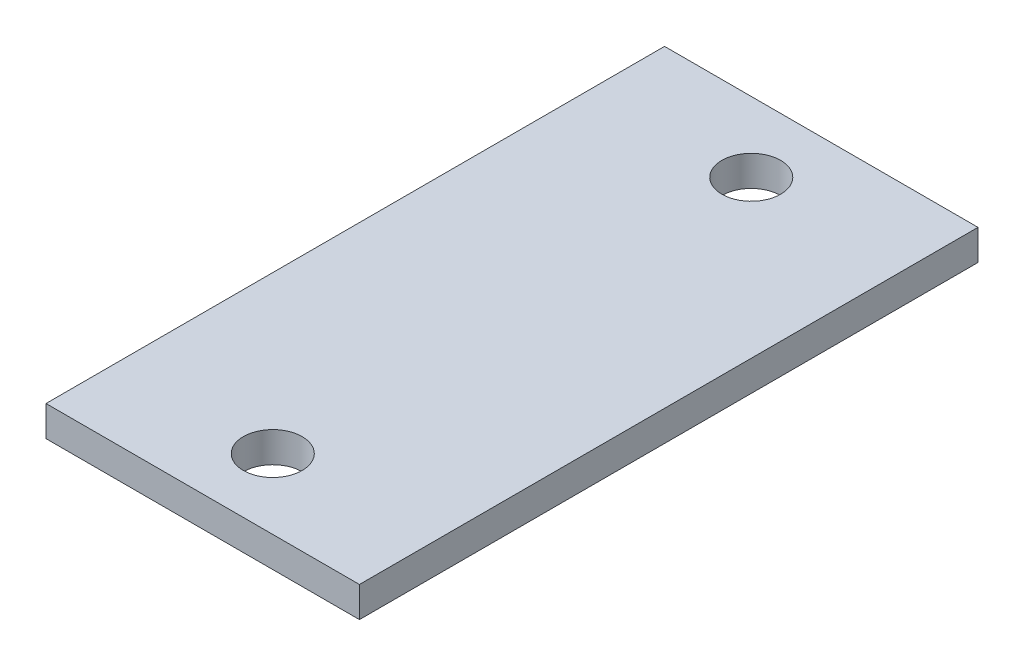
ISO-10303-21;
HEADER;
FILE_DESCRIPTION(('STEP AP214'),'2;1');
FILE_NAME('part.step','',(''),(''),'','','');
FILE_SCHEMA(('AUTOMOTIVE_DESIGN { 1 0 10303 214 1 1 1 1 }'));
ENDSEC;
DATA;
#1=APPLICATION_CONTEXT('core data for automotive mechanical design processes');
#2=APPLICATION_PROTOCOL_DEFINITION('international standard','automotive_design',2000,#1);
#3=PRODUCT_CONTEXT('',#1,'mechanical');
#4=PRODUCT('Part','Part','',(#3));
#5=PRODUCT_RELATED_PRODUCT_CATEGORY('part','',(#4));
#6=PRODUCT_DEFINITION_FORMATION('','',#4);
#7=PRODUCT_DEFINITION_CONTEXT('part definition',#1,'design');
#8=PRODUCT_DEFINITION('design','',#6,#7);
#9=PRODUCT_DEFINITION_SHAPE('','',#8);
#10=(LENGTH_UNIT() NAMED_UNIT(*) SI_UNIT(.MILLI.,.METRE.));
#11=(NAMED_UNIT(*) PLANE_ANGLE_UNIT() SI_UNIT($,.RADIAN.));
#12=(NAMED_UNIT(*) SI_UNIT($,.STERADIAN.) SOLID_ANGLE_UNIT());
#13=UNCERTAINTY_MEASURE_WITH_UNIT(LENGTH_MEASURE(1.E-05),#10,'distance_accuracy_value','');
#14=(GEOMETRIC_REPRESENTATION_CONTEXT(3) GLOBAL_UNCERTAINTY_ASSIGNED_CONTEXT((#13)) GLOBAL_UNIT_ASSIGNED_CONTEXT((#10,
#11,#12)) REPRESENTATION_CONTEXT('',''));
#15=CARTESIAN_POINT('',(0.,0.,0.));
#16=DIRECTION('',(0.,0.,1.));
#17=DIRECTION('',(1.,0.,0.));
#18=AXIS2_PLACEMENT_3D('',#15,#16,#17);
#19=CARTESIAN_POINT('',(0.,4.93522,0.));
#20=DIRECTION('',(0.,-1.,0.));
#21=DIRECTION('',(0.,0.,-1.));
#22=AXIS2_PLACEMENT_3D('',#19,#20,#21);
#23=PLANE('',#22);
#24=DIRECTION('',(0.,0.,1.));
#25=VECTOR('',#24,1.);
#26=CARTESIAN_POINT('',(0.,4.93522,0.));
#27=LINE('',#26,#25);
#28=CARTESIAN_POINT('',(0.,4.93522,-100.25));
#29=VERTEX_POINT('',#28);
#30=CARTESIAN_POINT('',(0.,4.93522,0.));
#31=VERTEX_POINT('',#30);
#32=EDGE_CURVE('E92',#29,#31,#27,.T.);
#33=ORIENTED_EDGE('',*,*,#32,.T.);
#34=DIRECTION('',(1.,0.,0.));
#35=VECTOR('',#34,1.);
#36=CARTESIAN_POINT('',(0.,4.93522,0.));
#37=LINE('',#36,#35);
#38=CARTESIAN_POINT('',(50.8,4.93522,0.));
#39=VERTEX_POINT('',#38);
#40=EDGE_CURVE('E87',#31,#39,#37,.T.);
#41=ORIENTED_EDGE('',*,*,#40,.T.);
#42=DIRECTION('',(0.,0.,-1.));
#43=VECTOR('',#42,1.);
#44=CARTESIAN_POINT('',(50.8,4.93522,0.));
#45=LINE('',#44,#43);
#46=CARTESIAN_POINT('',(50.8,4.93522,-100.25));
#47=VERTEX_POINT('',#46);
#48=EDGE_CURVE('E90',#39,#47,#45,.T.);
#49=ORIENTED_EDGE('',*,*,#48,.T.);
#50=DIRECTION('',(-1.,0.,0.));
#51=VECTOR('',#50,1.);
#52=CARTESIAN_POINT('',(0.,4.93522,-100.25));
#53=LINE('',#52,#51);
#54=EDGE_CURVE('E57',#47,#29,#53,.T.);
#55=ORIENTED_EDGE('',*,*,#54,.T.);
#56=EDGE_LOOP('',(#33,#41,#49,#55));
#57=FACE_BOUND('',#56,.T.);
#58=CARTESIAN_POINT('',(25.4,4.93522,-11.35));
#59=DIRECTION('',(0.,1.,0.));
#60=DIRECTION('',(0.,0.,1.));
#61=AXIS2_PLACEMENT_3D('',#58,#59,#60);
#62=CIRCLE('',#61,4.7625);
#63=CARTESIAN_POINT('',(25.4,4.93522,-6.58750000000001));
#64=VERTEX_POINT('',#63);
#65=EDGE_CURVE('E112',#64,#64,#62,.T.);
#66=ORIENTED_EDGE('',*,*,#65,.F.);
#67=EDGE_LOOP('',(#66));
#68=FACE_BOUND('',#67,.T.);
#69=CARTESIAN_POINT('',(25.4,4.93522,-88.9));
#70=DIRECTION('',(0.,1.,0.));
#71=DIRECTION('',(0.,0.,1.));
#72=AXIS2_PLACEMENT_3D('',#69,#70,#71);
#73=CIRCLE('',#72,4.7625);
#74=CARTESIAN_POINT('',(25.4,4.93522,-84.1375));
#75=VERTEX_POINT('',#74);
#76=EDGE_CURVE('E134',#75,#75,#73,.T.);
#77=ORIENTED_EDGE('',*,*,#76,.F.);
#78=EDGE_LOOP('',(#77));
#79=FACE_BOUND('',#78,.T.);
#80=ADVANCED_FACE('F39',(#57,#68,#79),#23,.F.);
#81=CARTESIAN_POINT('',(0.,0.,0.));
#82=DIRECTION('',(0.,-1.,0.));
#83=DIRECTION('',(0.,0.,-1.));
#84=AXIS2_PLACEMENT_3D('',#81,#82,#83);
#85=PLANE('',#84);
#86=CARTESIAN_POINT('',(25.4,0.,-11.35));
#87=DIRECTION('',(0.,1.,0.));
#88=DIRECTION('',(0.,0.,1.));
#89=AXIS2_PLACEMENT_3D('',#86,#87,#88);
#90=CIRCLE('',#89,4.7625);
#91=CARTESIAN_POINT('',(25.4,0.,-6.58750000000001));
#92=VERTEX_POINT('',#91);
#93=EDGE_CURVE('E130',#92,#92,#90,.T.);
#94=ORIENTED_EDGE('',*,*,#93,.T.);
#95=EDGE_LOOP('',(#94));
#96=FACE_BOUND('',#95,.T.);
#97=DIRECTION('',(0.,0.,1.));
#98=VECTOR('',#97,1.);
#99=CARTESIAN_POINT('',(0.,0.,0.));
#100=LINE('',#99,#98);
#101=CARTESIAN_POINT('',(0.,0.,-100.25));
#102=VERTEX_POINT('',#101);
#103=CARTESIAN_POINT('',(0.,0.,0.));
#104=VERTEX_POINT('',#103);
#105=EDGE_CURVE('E108',#102,#104,#100,.T.);
#106=ORIENTED_EDGE('',*,*,#105,.F.);
#107=DIRECTION('',(-1.,0.,0.));
#108=VECTOR('',#107,1.);
#109=CARTESIAN_POINT('',(0.,0.,-100.25));
#110=LINE('',#109,#108);
#111=CARTESIAN_POINT('',(50.8,0.,-100.25));
#112=VERTEX_POINT('',#111);
#113=EDGE_CURVE('E80',#112,#102,#110,.T.);
#114=ORIENTED_EDGE('',*,*,#113,.F.);
#115=DIRECTION('',(0.,0.,-1.));
#116=VECTOR('',#115,1.);
#117=CARTESIAN_POINT('',(50.8,0.,0.));
#118=LINE('',#117,#116);
#119=CARTESIAN_POINT('',(50.8,0.,0.));
#120=VERTEX_POINT('',#119);
#121=EDGE_CURVE('E74',#120,#112,#118,.T.);
#122=ORIENTED_EDGE('',*,*,#121,.F.);
#123=DIRECTION('',(1.,0.,0.));
#124=VECTOR('',#123,1.);
#125=CARTESIAN_POINT('',(0.,0.,0.));
#126=LINE('',#125,#124);
#127=EDGE_CURVE('E97',#104,#120,#126,.T.);
#128=ORIENTED_EDGE('',*,*,#127,.F.);
#129=EDGE_LOOP('',(#106,#114,#122,#128));
#130=FACE_BOUND('',#129,.T.);
#131=CARTESIAN_POINT('',(25.4,0.,-88.9));
#132=DIRECTION('',(0.,1.,0.));
#133=DIRECTION('',(0.,0.,1.));
#134=AXIS2_PLACEMENT_3D('',#131,#132,#133);
#135=CIRCLE('',#134,4.7625);
#136=CARTESIAN_POINT('',(25.4,0.,-84.1375));
#137=VERTEX_POINT('',#136);
#138=EDGE_CURVE('E138',#137,#137,#135,.T.);
#139=ORIENTED_EDGE('',*,*,#138,.T.);
#140=EDGE_LOOP('',(#139));
#141=FACE_BOUND('',#140,.T.);
#142=ADVANCED_FACE('F125',(#96,#130,#141),#85,.T.);
#143=CARTESIAN_POINT('',(0.,4.93522,0.));
#144=DIRECTION('',(1.,0.,0.));
#145=DIRECTION('',(0.,0.,-1.));
#146=AXIS2_PLACEMENT_3D('',#143,#144,#145);
#147=PLANE('',#146);
#148=ORIENTED_EDGE('',*,*,#105,.T.);
#149=DIRECTION('',(0.,-1.,0.));
#150=VECTOR('',#149,1.);
#151=CARTESIAN_POINT('',(0.,4.93522,0.));
#152=LINE('',#151,#150);
#153=EDGE_CURVE('E11',#31,#104,#152,.T.);
#154=ORIENTED_EDGE('',*,*,#153,.F.);
#155=ORIENTED_EDGE('',*,*,#32,.F.);
#156=DIRECTION('',(0.,-1.,0.));
#157=VECTOR('',#156,1.);
#158=CARTESIAN_POINT('',(0.,4.93522,-100.25));
#159=LINE('',#158,#157);
#160=EDGE_CURVE('E104',#29,#102,#159,.T.);
#161=ORIENTED_EDGE('',*,*,#160,.T.);
#162=EDGE_LOOP('',(#148,#154,#155,#161));
#163=FACE_BOUND('',#162,.T.);
#164=ADVANCED_FACE('F41',(#163),#147,.F.);
#165=CARTESIAN_POINT('',(0.,4.93522,0.));
#166=DIRECTION('',(0.,0.,-1.));
#167=DIRECTION('',(-1.,0.,0.));
#168=AXIS2_PLACEMENT_3D('',#165,#166,#167);
#169=PLANE('',#168);
#170=ORIENTED_EDGE('',*,*,#127,.T.);
#171=DIRECTION('',(0.,-1.,0.));
#172=VECTOR('',#171,1.);
#173=CARTESIAN_POINT('',(50.8,4.93522,0.));
#174=LINE('',#173,#172);
#175=EDGE_CURVE('E49',#39,#120,#174,.T.);
#176=ORIENTED_EDGE('',*,*,#175,.F.);
#177=ORIENTED_EDGE('',*,*,#40,.F.);
#178=ORIENTED_EDGE('',*,*,#153,.T.);
#179=EDGE_LOOP('',(#170,#176,#177,#178));
#180=FACE_BOUND('',#179,.T.);
#181=ADVANCED_FACE('F96',(#180),#169,.F.);
#182=CARTESIAN_POINT('',(50.8,4.93522,0.));
#183=DIRECTION('',(-1.,0.,0.));
#184=DIRECTION('',(0.,0.,1.));
#185=AXIS2_PLACEMENT_3D('',#182,#183,#184);
#186=PLANE('',#185);
#187=ORIENTED_EDGE('',*,*,#121,.T.);
#188=DIRECTION('',(0.,-1.,0.));
#189=VECTOR('',#188,1.);
#190=CARTESIAN_POINT('',(50.8,4.93522,-100.25));
#191=LINE('',#190,#189);
#192=EDGE_CURVE('E99',#47,#112,#191,.T.);
#193=ORIENTED_EDGE('',*,*,#192,.F.);
#194=ORIENTED_EDGE('',*,*,#48,.F.);
#195=ORIENTED_EDGE('',*,*,#175,.T.);
#196=EDGE_LOOP('',(#187,#193,#194,#195));
#197=FACE_BOUND('',#196,.T.);
#198=ADVANCED_FACE('F100',(#197),#186,.F.);
#199=CARTESIAN_POINT('',(0.,4.93522,-100.25));
#200=DIRECTION('',(0.,0.,1.));
#201=DIRECTION('',(1.,0.,0.));
#202=AXIS2_PLACEMENT_3D('',#199,#200,#201);
#203=PLANE('',#202);
#204=ORIENTED_EDGE('',*,*,#113,.T.);
#205=ORIENTED_EDGE('',*,*,#160,.F.);
#206=ORIENTED_EDGE('',*,*,#54,.F.);
#207=ORIENTED_EDGE('',*,*,#192,.T.);
#208=EDGE_LOOP('',(#204,#205,#206,#207));
#209=FACE_BOUND('',#208,.T.);
#210=ADVANCED_FACE('F122',(#209),#203,.F.);
#211=CARTESIAN_POINT('',(25.4,4.93522,-11.35));
#212=DIRECTION('',(0.,-1.,0.));
#213=DIRECTION('',(0.,0.,-1.));
#214=AXIS2_PLACEMENT_3D('',#211,#212,#213);
#215=CYLINDRICAL_SURFACE('',#214,4.7625);
#216=ORIENTED_EDGE('',*,*,#65,.T.);
#217=EDGE_LOOP('',(#216));
#218=FACE_BOUND('',#217,.T.);
#219=ORIENTED_EDGE('',*,*,#93,.F.);
#220=EDGE_LOOP('',(#219));
#221=FACE_BOUND('',#220,.T.);
#222=ADVANCED_FACE('F157',(#218,#221),#215,.F.);
#223=CARTESIAN_POINT('',(25.4,4.93522,-88.9));
#224=DIRECTION('',(0.,-1.,0.));
#225=DIRECTION('',(0.,0.,-1.));
#226=AXIS2_PLACEMENT_3D('',#223,#224,#225);
#227=CYLINDRICAL_SURFACE('',#226,4.7625);
#228=ORIENTED_EDGE('',*,*,#76,.T.);
#229=EDGE_LOOP('',(#228));
#230=FACE_BOUND('',#229,.T.);
#231=ORIENTED_EDGE('',*,*,#138,.F.);
#232=EDGE_LOOP('',(#231));
#233=FACE_BOUND('',#232,.T.);
#234=ADVANCED_FACE('F146',(#230,#233),#227,.F.);
#235=CLOSED_SHELL('',(#80,#142,#164,#181,#198,#210,#222,#234));
#236=MANIFOLD_SOLID_BREP('B2',#235);
#237=ADVANCED_BREP_SHAPE_REPRESENTATION('',(#18,#236),#14);
#238=SHAPE_DEFINITION_REPRESENTATION(#9,#237);
ENDSEC;
END-ISO-10303-21;
